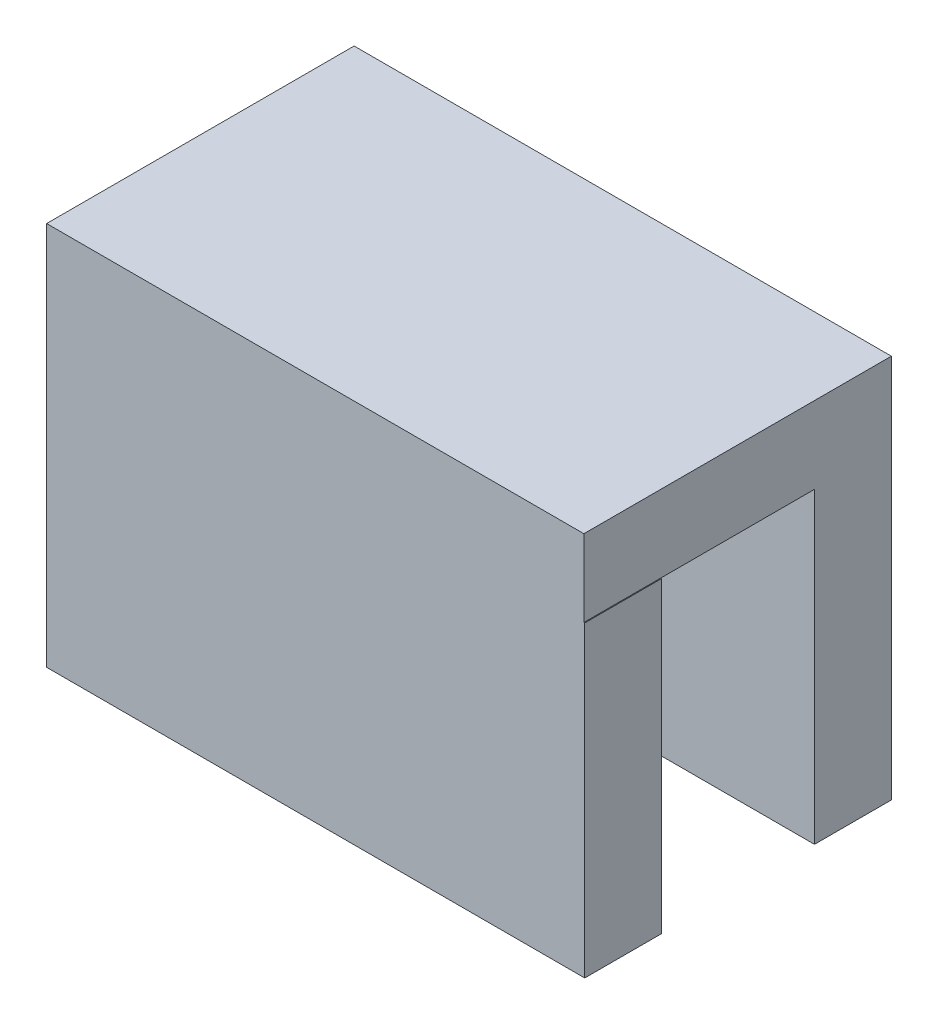
ISO-10303-21;
HEADER;
FILE_DESCRIPTION(('STEP AP214'),'2;1');
FILE_NAME('part.step','',(''),(''),'','','');
FILE_SCHEMA(('AUTOMOTIVE_DESIGN { 1 0 10303 214 1 1 1 1 }'));
ENDSEC;
DATA;
#1=APPLICATION_CONTEXT('core data for automotive mechanical design processes');
#2=APPLICATION_PROTOCOL_DEFINITION('international standard','automotive_design',2000,#1);
#3=PRODUCT_CONTEXT('',#1,'mechanical');
#4=PRODUCT('Part','Part','',(#3));
#5=PRODUCT_RELATED_PRODUCT_CATEGORY('part','',(#4));
#6=PRODUCT_DEFINITION_FORMATION('','',#4);
#7=PRODUCT_DEFINITION_CONTEXT('part definition',#1,'design');
#8=PRODUCT_DEFINITION('design','',#6,#7);
#9=PRODUCT_DEFINITION_SHAPE('','',#8);
#10=(LENGTH_UNIT() NAMED_UNIT(*) SI_UNIT(.MILLI.,.METRE.));
#11=(NAMED_UNIT(*) PLANE_ANGLE_UNIT() SI_UNIT($,.RADIAN.));
#12=(NAMED_UNIT(*) SI_UNIT($,.STERADIAN.) SOLID_ANGLE_UNIT());
#13=UNCERTAINTY_MEASURE_WITH_UNIT(LENGTH_MEASURE(1.E-05),#10,'distance_accuracy_value','');
#14=(GEOMETRIC_REPRESENTATION_CONTEXT(3) GLOBAL_UNCERTAINTY_ASSIGNED_CONTEXT((#13)) GLOBAL_UNIT_ASSIGNED_CONTEXT((#10,
#11,#12)) REPRESENTATION_CONTEXT('',''));
#15=CARTESIAN_POINT('',(0.,0.,0.));
#16=DIRECTION('',(0.,0.,1.));
#17=DIRECTION('',(1.,0.,0.));
#18=AXIS2_PLACEMENT_3D('',#15,#16,#17);
#19=CARTESIAN_POINT('',(0.,12.7,0.));
#20=DIRECTION('',(0.,-1.,0.));
#21=DIRECTION('',(0.,0.,-1.));
#22=AXIS2_PLACEMENT_3D('',#19,#20,#21);
#23=PLANE('',#22);
#24=DIRECTION('',(0.,0.,1.));
#25=VECTOR('',#24,1.);
#26=CARTESIAN_POINT('',(0.,12.7,3.175));
#27=LINE('',#26,#25);
#28=CARTESIAN_POINT('',(0.,12.7,-6.35));
#29=VERTEX_POINT('',#28);
#30=CARTESIAN_POINT('',(0.,12.7,0.));
#31=VERTEX_POINT('',#30);
#32=EDGE_CURVE('E136',#29,#31,#27,.T.);
#33=ORIENTED_EDGE('',*,*,#32,.F.);
#34=DIRECTION('',(-1.,0.,0.));
#35=VECTOR('',#34,1.);
#36=CARTESIAN_POINT('',(0.,12.7,-6.35));
#37=LINE('',#36,#35);
#38=CARTESIAN_POINT('',(19.0145562563066,12.7,-6.35));
#39=VERTEX_POINT('',#38);
#40=EDGE_CURVE('E144',#39,#29,#37,.T.);
#41=ORIENTED_EDGE('',*,*,#40,.F.);
#42=DIRECTION('',(0.,0.,-1.));
#43=VECTOR('',#42,1.);
#44=CARTESIAN_POINT('',(19.0145562563066,12.7,3.175));
#45=LINE('',#44,#43);
#46=CARTESIAN_POINT('',(19.0145562563066,12.7,0.));
#47=VERTEX_POINT('',#46);
#48=EDGE_CURVE('E188',#47,#39,#45,.T.);
#49=ORIENTED_EDGE('',*,*,#48,.F.);
#50=DIRECTION('',(-1.,0.,0.));
#51=VECTOR('',#50,1.);
#52=CARTESIAN_POINT('',(0.,12.7,0.));
#53=LINE('',#52,#51);
#54=EDGE_CURVE('E214',#47,#31,#53,.T.);
#55=ORIENTED_EDGE('',*,*,#54,.T.);
#56=EDGE_LOOP('',(#33,#41,#49,#55));
#57=FACE_BOUND('',#56,.T.);
#58=ADVANCED_FACE('F39',(#57),#23,.T.);
#59=CARTESIAN_POINT('',(0.,0.,0.));
#60=DIRECTION('',(-1.,0.,0.));
#61=DIRECTION('',(0.,0.,1.));
#62=AXIS2_PLACEMENT_3D('',#59,#60,#61);
#63=PLANE('',#62);
#64=CARTESIAN_POINT('',(0.,5.08,-3.175));
#65=DIRECTION('',(-1.,0.,0.));
#66=DIRECTION('',(0.,0.,1.));
#67=AXIS2_PLACEMENT_3D('',#64,#65,#66);
#68=CIRCLE('',#67,2.54);
#69=CARTESIAN_POINT('',(0.,5.08,-0.634999999999999));
#70=VERTEX_POINT('',#69);
#71=EDGE_CURVE('E159',#70,#70,#68,.T.);
#72=ORIENTED_EDGE('',*,*,#71,.T.);
#73=EDGE_LOOP('',(#72));
#74=FACE_BOUND('',#73,.T.);
#75=DIRECTION('',(0.,1.,0.));
#76=VECTOR('',#75,1.);
#77=CARTESIAN_POINT('',(0.,0.,-6.35));
#78=LINE('',#77,#76);
#79=CARTESIAN_POINT('',(0.,0.,-6.35));
#80=VERTEX_POINT('',#79);
#81=EDGE_CURVE('E55',#80,#29,#78,.T.);
#82=ORIENTED_EDGE('',*,*,#81,.T.);
#83=ORIENTED_EDGE('',*,*,#32,.T.);
#84=DIRECTION('',(0.,-1.,0.));
#85=VECTOR('',#84,1.);
#86=CARTESIAN_POINT('',(0.,0.,0.));
#87=LINE('',#86,#85);
#88=CARTESIAN_POINT('',(0.,0.,0.));
#89=VERTEX_POINT('',#88);
#90=EDGE_CURVE('E194',#31,#89,#87,.T.);
#91=ORIENTED_EDGE('',*,*,#90,.T.);
#92=DIRECTION('',(0.,0.,1.));
#93=VECTOR('',#92,1.);
#94=CARTESIAN_POINT('',(0.,0.,-9.525));
#95=LINE('',#94,#93);
#96=EDGE_CURVE('E163',#80,#89,#95,.T.);
#97=ORIENTED_EDGE('',*,*,#96,.F.);
#98=EDGE_LOOP('',(#82,#83,#91,#97));
#99=FACE_BOUND('',#98,.T.);
#100=ADVANCED_FACE('F244',(#74,#99),#63,.F.);
#101=CARTESIAN_POINT('',(0.,12.7,3.175));
#102=DIRECTION('',(0.,-1.,0.));
#103=DIRECTION('',(0.,0.,-1.));
#104=AXIS2_PLACEMENT_3D('',#101,#102,#103);
#105=PLANE('',#104);
#106=CARTESIAN_POINT('',(19.0145562563066,12.7,3.175));
#107=VERTEX_POINT('',#106);
#108=EDGE_CURVE('E63',#107,#47,#45,.T.);
#109=ORIENTED_EDGE('',*,*,#108,.F.);
#110=DIRECTION('',(-1.,0.,0.));
#111=VECTOR('',#110,1.);
#112=CARTESIAN_POINT('',(0.,12.7,3.175));
#113=LINE('',#112,#111);
#114=CARTESIAN_POINT('',(19.05,12.7,3.175));
#115=VERTEX_POINT('',#114);
#116=EDGE_CURVE('E202',#115,#107,#113,.T.);
#117=ORIENTED_EDGE('',*,*,#116,.F.);
#118=DIRECTION('',(0.,0.,-1.));
#119=VECTOR('',#118,1.);
#120=CARTESIAN_POINT('',(19.05,12.7,3.175));
#121=LINE('',#120,#119);
#122=CARTESIAN_POINT('',(19.05,12.7,0.));
#123=VERTEX_POINT('',#122);
#124=EDGE_CURVE('E48',#115,#123,#121,.T.);
#125=ORIENTED_EDGE('',*,*,#124,.T.);
#126=EDGE_CURVE('E199',#123,#47,#53,.T.);
#127=ORIENTED_EDGE('',*,*,#126,.T.);
#128=EDGE_LOOP('',(#109,#117,#125,#127));
#129=FACE_BOUND('',#128,.T.);
#130=ADVANCED_FACE('F220',(#129),#105,.F.);
#131=CARTESIAN_POINT('',(0.,0.,3.175));
#132=DIRECTION('',(0.,1.,0.));
#133=DIRECTION('',(0.,0.,1.));
#134=AXIS2_PLACEMENT_3D('',#131,#132,#133);
#135=PLANE('',#134);
#136=DIRECTION('',(1.,0.,0.));
#137=VECTOR('',#136,1.);
#138=CARTESIAN_POINT('',(0.,0.,0.));
#139=LINE('',#138,#137);
#140=CARTESIAN_POINT('',(19.05,0.,0.));
#141=VERTEX_POINT('',#140);
#142=EDGE_CURVE('E208',#89,#141,#139,.T.);
#143=ORIENTED_EDGE('',*,*,#142,.T.);
#144=DIRECTION('',(0.,0.,-1.));
#145=VECTOR('',#144,1.);
#146=CARTESIAN_POINT('',(19.05,0.,3.175));
#147=LINE('',#146,#145);
#148=CARTESIAN_POINT('',(19.05,0.,3.175));
#149=VERTEX_POINT('',#148);
#150=EDGE_CURVE('E11',#149,#141,#147,.T.);
#151=ORIENTED_EDGE('',*,*,#150,.F.);
#152=DIRECTION('',(1.,0.,0.));
#153=VECTOR('',#152,1.);
#154=CARTESIAN_POINT('',(0.,0.,3.175));
#155=LINE('',#154,#153);
#156=CARTESIAN_POINT('',(-3.175,0.,3.175));
#157=VERTEX_POINT('',#156);
#158=EDGE_CURVE('E195',#157,#149,#155,.T.);
#159=ORIENTED_EDGE('',*,*,#158,.F.);
#160=DIRECTION('',(0.,0.,1.));
#161=VECTOR('',#160,1.);
#162=CARTESIAN_POINT('',(-3.175,0.,-9.525));
#163=LINE('',#162,#161);
#164=CARTESIAN_POINT('',(-3.175,0.,-9.525));
#165=VERTEX_POINT('',#164);
#166=EDGE_CURVE('E133',#165,#157,#163,.T.);
#167=ORIENTED_EDGE('',*,*,#166,.F.);
#168=DIRECTION('',(1.,0.,0.));
#169=VECTOR('',#168,1.);
#170=CARTESIAN_POINT('',(-3.175,0.,-9.525));
#171=LINE('',#170,#169);
#172=CARTESIAN_POINT('',(19.0145562563066,0.,-9.525));
#173=VERTEX_POINT('',#172);
#174=EDGE_CURVE('E121',#165,#173,#171,.T.);
#175=ORIENTED_EDGE('',*,*,#174,.T.);
#176=DIRECTION('',(0.,0.,1.));
#177=VECTOR('',#176,1.);
#178=CARTESIAN_POINT('',(19.0145562563066,0.,-9.525));
#179=LINE('',#178,#177);
#180=CARTESIAN_POINT('',(19.0145562563066,0.,-6.35));
#181=VERTEX_POINT('',#180);
#182=EDGE_CURVE('E130',#173,#181,#179,.T.);
#183=ORIENTED_EDGE('',*,*,#182,.T.);
#184=DIRECTION('',(-1.,0.,0.));
#185=VECTOR('',#184,1.);
#186=CARTESIAN_POINT('',(0.,0.,-6.35));
#187=LINE('',#186,#185);
#188=EDGE_CURVE('E143',#181,#80,#187,.T.);
#189=ORIENTED_EDGE('',*,*,#188,.T.);
#190=ORIENTED_EDGE('',*,*,#96,.T.);
#191=EDGE_LOOP('',(#143,#151,#159,#167,#175,#183,#189,#190));
#192=FACE_BOUND('',#191,.T.);
#193=ADVANCED_FACE('F41',(#192),#135,.F.);
#194=CARTESIAN_POINT('',(19.05,0.,3.175));
#195=DIRECTION('',(-1.,0.,0.));
#196=DIRECTION('',(0.,0.,1.));
#197=AXIS2_PLACEMENT_3D('',#194,#195,#196);
#198=PLANE('',#197);
#199=DIRECTION('',(0.,1.,0.));
#200=VECTOR('',#199,1.);
#201=CARTESIAN_POINT('',(19.05,0.,0.));
#202=LINE('',#201,#200);
#203=EDGE_CURVE('E211',#141,#123,#202,.T.);
#204=ORIENTED_EDGE('',*,*,#203,.T.);
#205=ORIENTED_EDGE('',*,*,#124,.F.);
#206=DIRECTION('',(0.,1.,0.));
#207=VECTOR('',#206,1.);
#208=CARTESIAN_POINT('',(19.05,0.,3.175));
#209=LINE('',#208,#207);
#210=EDGE_CURVE('E198',#149,#115,#209,.T.);
#211=ORIENTED_EDGE('',*,*,#210,.F.);
#212=ORIENTED_EDGE('',*,*,#150,.T.);
#213=EDGE_LOOP('',(#204,#205,#211,#212));
#214=FACE_BOUND('',#213,.T.);
#215=ADVANCED_FACE('F241',(#214),#198,.F.);
#216=CARTESIAN_POINT('',(0.,0.,3.175));
#217=DIRECTION('',(0.,0.,-1.));
#218=DIRECTION('',(-1.,0.,0.));
#219=AXIS2_PLACEMENT_3D('',#216,#217,#218);
#220=PLANE('',#219);
#221=DIRECTION('',(1.,0.,0.));
#222=VECTOR('',#221,1.);
#223=CARTESIAN_POINT('',(0.,15.875,3.175));
#224=LINE('',#223,#222);
#225=CARTESIAN_POINT('',(-3.175,15.875,3.175));
#226=VERTEX_POINT('',#225);
#227=CARTESIAN_POINT('',(19.0145562563066,15.875,3.175));
#228=VERTEX_POINT('',#227);
#229=EDGE_CURVE('E178',#226,#228,#224,.T.);
#230=ORIENTED_EDGE('',*,*,#229,.F.);
#231=DIRECTION('',(0.,1.,0.));
#232=VECTOR('',#231,1.);
#233=CARTESIAN_POINT('',(-3.175,15.875,3.175));
#234=LINE('',#233,#232);
#235=EDGE_CURVE('E169',#157,#226,#234,.T.);
#236=ORIENTED_EDGE('',*,*,#235,.F.);
#237=ORIENTED_EDGE('',*,*,#158,.T.);
#238=ORIENTED_EDGE('',*,*,#210,.T.);
#239=ORIENTED_EDGE('',*,*,#116,.T.);
#240=DIRECTION('',(0.,-1.,0.));
#241=VECTOR('',#240,1.);
#242=CARTESIAN_POINT('',(19.0145562563066,15.875,3.175));
#243=LINE('',#242,#241);
#244=EDGE_CURVE('E127',#228,#107,#243,.T.);
#245=ORIENTED_EDGE('',*,*,#244,.F.);
#246=EDGE_LOOP('',(#230,#236,#237,#238,#239,#245));
#247=FACE_BOUND('',#246,.T.);
#248=ADVANCED_FACE('F238',(#247),#220,.F.);
#249=CARTESIAN_POINT('',(0.,0.,0.));
#250=DIRECTION('',(0.,0.,-1.));
#251=DIRECTION('',(-1.,0.,0.));
#252=AXIS2_PLACEMENT_3D('',#249,#250,#251);
#253=PLANE('',#252);
#254=ORIENTED_EDGE('',*,*,#90,.F.);
#255=ORIENTED_EDGE('',*,*,#54,.F.);
#256=ORIENTED_EDGE('',*,*,#126,.F.);
#257=ORIENTED_EDGE('',*,*,#203,.F.);
#258=ORIENTED_EDGE('',*,*,#142,.F.);
#259=EDGE_LOOP('',(#254,#255,#256,#257,#258));
#260=FACE_BOUND('',#259,.T.);
#261=ADVANCED_FACE('F227',(#260),#253,.T.);
#262=CARTESIAN_POINT('',(19.0145562563066,15.875,3.175));
#263=DIRECTION('',(-1.,0.,0.));
#264=DIRECTION('',(0.,0.,1.));
#265=AXIS2_PLACEMENT_3D('',#262,#263,#264);
#266=PLANE('',#265);
#267=ORIENTED_EDGE('',*,*,#108,.T.);
#268=ORIENTED_EDGE('',*,*,#48,.T.);
#269=DIRECTION('',(0.,1.,0.));
#270=VECTOR('',#269,1.);
#271=CARTESIAN_POINT('',(19.0145562563066,0.,-6.35));
#272=LINE('',#271,#270);
#273=EDGE_CURVE('E141',#181,#39,#272,.T.);
#274=ORIENTED_EDGE('',*,*,#273,.F.);
#275=ORIENTED_EDGE('',*,*,#182,.F.);
#276=DIRECTION('',(0.,-1.,0.));
#277=VECTOR('',#276,1.);
#278=CARTESIAN_POINT('',(19.0145562563066,15.875,-9.525));
#279=LINE('',#278,#277);
#280=CARTESIAN_POINT('',(19.0145562563066,15.875,-9.525));
#281=VERTEX_POINT('',#280);
#282=EDGE_CURVE('E117',#281,#173,#279,.T.);
#283=ORIENTED_EDGE('',*,*,#282,.F.);
#284=DIRECTION('',(0.,0.,-1.));
#285=VECTOR('',#284,1.);
#286=CARTESIAN_POINT('',(19.0145562563066,15.875,3.175));
#287=LINE('',#286,#285);
#288=EDGE_CURVE('E181',#228,#281,#287,.T.);
#289=ORIENTED_EDGE('',*,*,#288,.F.);
#290=ORIENTED_EDGE('',*,*,#244,.T.);
#291=EDGE_LOOP('',(#267,#268,#274,#275,#283,#289,#290));
#292=FACE_BOUND('',#291,.T.);
#293=ADVANCED_FACE('F139',(#292),#266,.F.);
#294=CARTESIAN_POINT('',(0.,15.875,-9.525));
#295=DIRECTION('',(0.,0.,1.));
#296=DIRECTION('',(1.,0.,0.));
#297=AXIS2_PLACEMENT_3D('',#294,#295,#296);
#298=PLANE('',#297);
#299=ORIENTED_EDGE('',*,*,#282,.T.);
#300=ORIENTED_EDGE('',*,*,#174,.F.);
#301=DIRECTION('',(0.,-1.,0.));
#302=VECTOR('',#301,1.);
#303=CARTESIAN_POINT('',(-3.175,15.875,-9.525));
#304=LINE('',#303,#302);
#305=CARTESIAN_POINT('',(-3.175,15.875,-9.525));
#306=VERTEX_POINT('',#305);
#307=EDGE_CURVE('E164',#306,#165,#304,.T.);
#308=ORIENTED_EDGE('',*,*,#307,.F.);
#309=DIRECTION('',(-1.,0.,0.));
#310=VECTOR('',#309,1.);
#311=CARTESIAN_POINT('',(0.,15.875,-9.525));
#312=LINE('',#311,#310);
#313=EDGE_CURVE('E122',#281,#306,#312,.T.);
#314=ORIENTED_EDGE('',*,*,#313,.F.);
#315=EDGE_LOOP('',(#299,#300,#308,#314));
#316=FACE_BOUND('',#315,.T.);
#317=ADVANCED_FACE('F119',(#316),#298,.F.);
#318=CARTESIAN_POINT('',(0.,15.875,0.));
#319=DIRECTION('',(0.,-1.,0.));
#320=DIRECTION('',(0.,0.,-1.));
#321=AXIS2_PLACEMENT_3D('',#318,#319,#320);
#322=PLANE('',#321);
#323=ORIENTED_EDGE('',*,*,#313,.T.);
#324=DIRECTION('',(0.,0.,-1.));
#325=VECTOR('',#324,1.);
#326=CARTESIAN_POINT('',(-3.175,15.875,-9.525));
#327=LINE('',#326,#325);
#328=EDGE_CURVE('E137',#226,#306,#327,.T.);
#329=ORIENTED_EDGE('',*,*,#328,.F.);
#330=ORIENTED_EDGE('',*,*,#229,.T.);
#331=ORIENTED_EDGE('',*,*,#288,.T.);
#332=EDGE_LOOP('',(#323,#329,#330,#331));
#333=FACE_BOUND('',#332,.T.);
#334=ADVANCED_FACE('F258',(#333),#322,.F.);
#335=CARTESIAN_POINT('',(-3.175,0.,0.));
#336=DIRECTION('',(-1.,0.,0.));
#337=DIRECTION('',(0.,0.,1.));
#338=AXIS2_PLACEMENT_3D('',#335,#336,#337);
#339=PLANE('',#338);
#340=CARTESIAN_POINT('',(-3.175,5.08,-3.175));
#341=DIRECTION('',(-1.,0.,0.));
#342=DIRECTION('',(0.,0.,1.));
#343=AXIS2_PLACEMENT_3D('',#340,#341,#342);
#344=CIRCLE('',#343,2.54);
#345=CARTESIAN_POINT('',(-3.175,5.08,-0.634999999999999));
#346=VERTEX_POINT('',#345);
#347=EDGE_CURVE('E155',#346,#346,#344,.T.);
#348=ORIENTED_EDGE('',*,*,#347,.F.);
#349=EDGE_LOOP('',(#348));
#350=FACE_BOUND('',#349,.T.);
#351=ORIENTED_EDGE('',*,*,#307,.T.);
#352=ORIENTED_EDGE('',*,*,#166,.T.);
#353=ORIENTED_EDGE('',*,*,#235,.T.);
#354=ORIENTED_EDGE('',*,*,#328,.T.);
#355=EDGE_LOOP('',(#351,#352,#353,#354));
#356=FACE_BOUND('',#355,.T.);
#357=ADVANCED_FACE('F256',(#350,#356),#339,.T.);
#358=CARTESIAN_POINT('',(19.05,5.08,-3.175));
#359=DIRECTION('',(-1.,0.,0.));
#360=DIRECTION('',(0.,0.,1.));
#361=AXIS2_PLACEMENT_3D('',#358,#359,#360);
#362=CYLINDRICAL_SURFACE('',#361,2.54);
#363=ORIENTED_EDGE('',*,*,#347,.T.);
#364=EDGE_LOOP('',(#363));
#365=FACE_BOUND('',#364,.T.);
#366=ORIENTED_EDGE('',*,*,#71,.F.);
#367=EDGE_LOOP('',(#366));
#368=FACE_BOUND('',#367,.T.);
#369=ADVANCED_FACE('F314',(#365,#368),#362,.F.);
#370=CARTESIAN_POINT('',(0.,0.,-6.35));
#371=DIRECTION('',(0.,0.,-1.));
#372=DIRECTION('',(-1.,0.,0.));
#373=AXIS2_PLACEMENT_3D('',#370,#371,#372);
#374=PLANE('',#373);
#375=ORIENTED_EDGE('',*,*,#40,.T.);
#376=ORIENTED_EDGE('',*,*,#81,.F.);
#377=ORIENTED_EDGE('',*,*,#188,.F.);
#378=ORIENTED_EDGE('',*,*,#273,.T.);
#379=EDGE_LOOP('',(#375,#376,#377,#378));
#380=FACE_BOUND('',#379,.T.);
#381=ADVANCED_FACE('F323',(#380),#374,.F.);
#382=CLOSED_SHELL('',(#58,#100,#130,#193,#215,#248,#261,#293,#317,#334,#357,#369,#381));
#383=MANIFOLD_SOLID_BREP('B2',#382);
#384=ADVANCED_BREP_SHAPE_REPRESENTATION('',(#18,#383),#14);
#385=SHAPE_DEFINITION_REPRESENTATION(#9,#384);
ENDSEC;
END-ISO-10303-21;
